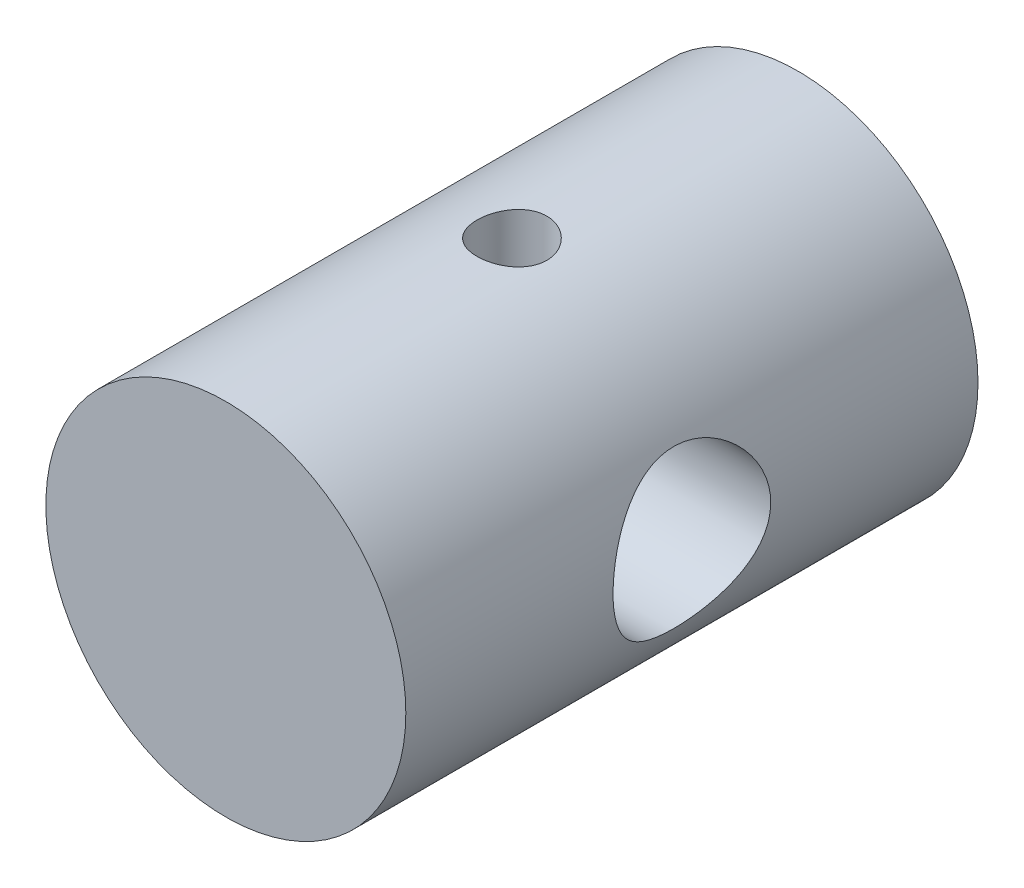
ISO-10303-21;
HEADER;
FILE_DESCRIPTION(('STEP AP214'),'2;1');
FILE_NAME('part.step','',(''),(''),'','','');
FILE_SCHEMA(('AUTOMOTIVE_DESIGN { 1 0 10303 214 1 1 1 1 }'));
ENDSEC;
DATA;
#1=APPLICATION_CONTEXT('core data for automotive mechanical design processes');
#2=APPLICATION_PROTOCOL_DEFINITION('international standard','automotive_design',2000,#1);
#3=PRODUCT_CONTEXT('',#1,'mechanical');
#4=PRODUCT('Part','Part','',(#3));
#5=PRODUCT_RELATED_PRODUCT_CATEGORY('part','',(#4));
#6=PRODUCT_DEFINITION_FORMATION('','',#4);
#7=PRODUCT_DEFINITION_CONTEXT('part definition',#1,'design');
#8=PRODUCT_DEFINITION('design','',#6,#7);
#9=PRODUCT_DEFINITION_SHAPE('','',#8);
#10=(LENGTH_UNIT() NAMED_UNIT(*) SI_UNIT(.MILLI.,.METRE.));
#11=(NAMED_UNIT(*) PLANE_ANGLE_UNIT() SI_UNIT($,.RADIAN.));
#12=(NAMED_UNIT(*) SI_UNIT($,.STERADIAN.) SOLID_ANGLE_UNIT());
#13=UNCERTAINTY_MEASURE_WITH_UNIT(LENGTH_MEASURE(1.E-05),#10,'distance_accuracy_value','');
#14=(GEOMETRIC_REPRESENTATION_CONTEXT(3) GLOBAL_UNCERTAINTY_ASSIGNED_CONTEXT((#13)) GLOBAL_UNIT_ASSIGNED_CONTEXT((#10,
#11,#12)) REPRESENTATION_CONTEXT('',''));
#15=CARTESIAN_POINT('',(0.,0.,0.));
#16=DIRECTION('',(0.,0.,1.));
#17=DIRECTION('',(1.,0.,0.));
#18=AXIS2_PLACEMENT_3D('',#15,#16,#17);
#19=CARTESIAN_POINT('',(0.,0.,25.4));
#20=DIRECTION('',(0.,0.,-1.));
#21=DIRECTION('',(-1.,0.,0.));
#22=AXIS2_PLACEMENT_3D('',#19,#20,#21);
#23=CYLINDRICAL_SURFACE('',#22,7.99);
#24=CARTESIAN_POINT('',(0.,-7.99,14.25));
#25=CARTESIAN_POINT('',(0.0861978751298495,-7.98999842231098,14.2499967674018));
#26=CARTESIAN_POINT('',(0.172437191972722,-7.98859075930084,14.2427853096281));
#27=CARTESIAN_POINT('',(0.342481834557587,-7.98311104184808,14.2141508054915));
#28=CARTESIAN_POINT('',(0.426285109089739,-7.97903680629046,14.1927161250874));
#29=CARTESIAN_POINT('',(0.588974198315108,-7.96867928535314,14.1363193045079));
#30=CARTESIAN_POINT('',(0.667864512920315,-7.9623980575206,14.1013697610034));
#31=CARTESIAN_POINT('',(0.818655284205226,-7.9483108799168,14.0189719257152));
#32=CARTESIAN_POINT('',(0.890556229375864,-7.94050503681667,13.9715245082759));
#33=CARTESIAN_POINT('',(1.02625240760753,-7.92411741098245,13.8648345792747));
#34=CARTESIAN_POINT('',(1.08994543199363,-7.91552776882728,13.8054632652412));
#35=CARTESIAN_POINT('',(1.20653313679711,-7.89859839067425,13.6768878538532));
#36=CARTESIAN_POINT('',(1.25942700747572,-7.89025867345615,13.6076830198241));
#37=CARTESIAN_POINT('',(1.35334514291691,-7.87469682894811,13.460676118599));
#38=CARTESIAN_POINT('',(1.39426448283677,-7.86748482458875,13.3828058520177));
#39=CARTESIAN_POINT('',(1.46240006584402,-7.85510617264537,13.2211325420263));
#40=CARTESIAN_POINT('',(1.48961757823757,-7.84993933561119,13.1373300489848));
#41=CARTESIAN_POINT('',(1.52924693388355,-7.8423153468224,12.9672678781094));
#42=CARTESIAN_POINT('',(1.54183758101501,-7.83982549930373,12.8810513619589));
#43=CARTESIAN_POINT('',(1.55241099834209,-7.83773890828445,12.7076964312001));
#44=CARTESIAN_POINT('',(1.55039517220651,-7.83814188678585,12.6205581059804));
#45=CARTESIAN_POINT('',(1.53195763558272,-7.84176567979317,12.4491350151866));
#46=CARTESIAN_POINT('',(1.51574008927123,-7.84494655741215,12.3648273210157));
#47=CARTESIAN_POINT('',(1.46968137404701,-7.85370493560441,12.2001525076992));
#48=CARTESIAN_POINT('',(1.43983958940467,-7.85928254449414,12.1197855668325));
#49=CARTESIAN_POINT('',(1.36718225054554,-7.8722472080614,11.9646808166584));
#50=CARTESIAN_POINT('',(1.32428503440038,-7.87964559432129,11.8899822474469));
#51=CARTESIAN_POINT('',(1.22679221117265,-7.89541082046154,11.7487668086265));
#52=CARTESIAN_POINT('',(1.17219533621401,-7.90377776525805,11.6822508269842));
#53=CARTESIAN_POINT('',(1.0517561459926,-7.9207108696417,11.5581098806869));
#54=CARTESIAN_POINT('',(0.985739393878354,-7.92927800643286,11.5006541509022));
#55=CARTESIAN_POINT('',(0.844916058245292,-7.94551649988089,11.3976063311598));
#56=CARTESIAN_POINT('',(0.770109374423323,-7.95318784631378,11.3520143766003));
#57=CARTESIAN_POINT('',(0.61364727179666,-7.96678757875038,11.2739601087841));
#58=CARTESIAN_POINT('',(0.531982399977755,-7.97271350654225,11.2415162891621));
#59=CARTESIAN_POINT('',(0.364221022567462,-7.98213589507914,11.1908551245955));
#60=CARTESIAN_POINT('',(0.278125022680507,-7.98563263239915,11.1726361600537));
#61=CARTESIAN_POINT('',(0.105400460069949,-7.98976439233566,11.1511794990004));
#62=CARTESIAN_POINT('',(0.0188017098618922,-7.99044367672728,11.1477100675722));
#63=CARTESIAN_POINT('',(-0.15373828419959,-7.98898660476214,11.1552280794807));
#64=CARTESIAN_POINT('',(-0.239679562492628,-7.98685039691604,11.1662147602912));
#65=CARTESIAN_POINT('',(-0.407723594516296,-7.98002999851957,11.2021405284203));
#66=CARTESIAN_POINT('',(-0.489852548994056,-7.9753673845908,11.2269615153625));
#67=CARTESIAN_POINT('',(-0.64878308274747,-7.96401494033863,11.2897228761182));
#68=CARTESIAN_POINT('',(-0.725584280356087,-7.95732496496411,11.3276641886758));
#69=CARTESIAN_POINT('',(-0.872662216920443,-7.94254953182289,11.416096153705));
#70=CARTESIAN_POINT('',(-0.942852890084782,-7.93444877954137,11.4667273401462));
#71=CARTESIAN_POINT('',(-1.07382484178543,-7.91778800047293,11.5789126775947));
#72=CARTESIAN_POINT('',(-1.13460517415467,-7.90922792761978,11.6404679256333));
#73=CARTESIAN_POINT('',(-1.24591875917,-7.89246523051891,11.7738061909469));
#74=CARTESIAN_POINT('',(-1.2962933776322,-7.88426945175633,11.8457226460713));
#75=CARTESIAN_POINT('',(-1.3842477449932,-7.86930472352804,11.997132758846));
#76=CARTESIAN_POINT('',(-1.42182798899722,-7.86253571885416,12.0766261231393));
#77=CARTESIAN_POINT('',(-1.48290618198976,-7.85124547324545,12.240544433606));
#78=CARTESIAN_POINT('',(-1.50647475244843,-7.84671297988975,12.3249422536092));
#79=CARTESIAN_POINT('',(-1.53907658113647,-7.84038417338833,12.4965967926561));
#80=CARTESIAN_POINT('',(-1.54811160910461,-7.83858752710195,12.5838531622957));
#81=CARTESIAN_POINT('',(-1.55132743435128,-7.83795155711542,12.7571570468987));
#82=CARTESIAN_POINT('',(-1.54575867983169,-7.83906237116802,12.8431998302404));
#83=CARTESIAN_POINT('',(-1.52047560033483,-7.84400516541365,13.0130975937471));
#84=CARTESIAN_POINT('',(-1.50076137439544,-7.84783712655489,13.0969525892254));
#85=CARTESIAN_POINT('',(-1.44785575987647,-7.85776878425971,13.2599471045278));
#86=CARTESIAN_POINT('',(-1.41469333272468,-7.86386360526504,13.3390963410897));
#87=CARTESIAN_POINT('',(-1.33586074287948,-7.87763734874023,13.4907471039831));
#88=CARTESIAN_POINT('',(-1.29018961132125,-7.88531639390518,13.5632481147939));
#89=CARTESIAN_POINT('',(-1.18677317118979,-7.90154700012123,13.7007951351408));
#90=CARTESIAN_POINT('',(-1.12884630514387,-7.91011055927908,13.7657032468729));
#91=CARTESIAN_POINT('',(-1.00293943400774,-7.92705741856957,13.8849610023149));
#92=CARTESIAN_POINT('',(-0.934957122842554,-7.93544067684626,13.9393082173989));
#93=CARTESIAN_POINT('',(-0.790074313987382,-7.95117843922266,14.036398924293));
#94=CARTESIAN_POINT('',(-0.713093383365353,-7.95852212495652,14.0790242081759));
#95=CARTESIAN_POINT('',(-0.552942586581527,-7.97124726985033,14.1506671077489));
#96=CARTESIAN_POINT('',(-0.469778495856717,-7.9766305331095,14.1796972415906));
#97=CARTESIAN_POINT('',(-0.321999134602491,-7.98375715202776,14.2175702451031));
#98=CARTESIAN_POINT('',(-0.258236462211612,-7.98608475478528,14.2297101626809));
#99=CARTESIAN_POINT('',(-0.129656989572553,-7.98920675022882,14.2459261406032));
#100=CARTESIAN_POINT('',(-0.0648402195347914,-7.99000118677754,14.2500024316421));
#101=CARTESIAN_POINT('',(0.,-7.99,14.25));
#102=B_SPLINE_CURVE_WITH_KNOTS('',3,(#24,#25,#26,#27,#28,#29,#30,#31,#32,#33,#34,#35,#36,#37,
#38,#39,#40,#41,#42,#43,#44,#45,#46,#47,#48,#49,#50,#51,#52,#53,#54,#55,#56,#57,#58,#59,#60,#61,
#62,#63,#64,#65,#66,#67,#68,#69,#70,#71,#72,#73,#74,#75,#76,#77,#78,#79,#80,#81,#82,#83,#84,#85,
#86,#87,#88,#89,#90,#91,#92,#93,#94,#95,#96,#97,#98,#99,#100,#101),.UNSPECIFIED.,.T.,.F.,(4,2,2,
2,2,2,2,2,2,2,2,2,2,2,2,2,2,2,2,2,2,2,2,2,2,2,2,2,2,2,2,2,2,2,2,2,2,2,4),(0.,0.258356459834737,
0.516924506101675,0.775252129928376,1.03356168609266,1.29482814177584,1.55611418046989,
1.81962548034444,2.08311236463688,2.3433432256181,2.60354907898222,2.86007450740786,
3.116611530312,3.37478737748871,3.63299121699184,3.89555821585245,4.15812821119313,
4.42106625563359,4.68397435840918,4.9427361951571,5.2014843833682,5.4580568000188,
5.71464757792855,5.9742162823569,6.23381106831601,6.49711095392199,6.76040064942693,
7.02235181046594,7.28427107148926,7.54172802891493,7.7991831838033,8.05608681482289,
8.31301035000702,8.57404617365163,8.83514195528014,9.09878146702062,9.36217774496427,
9.55652556186892,9.75086781855078),.UNSPECIFIED.);
#103=CARTESIAN_POINT('',(0.,-7.99,14.25));
#104=VERTEX_POINT('',#103);
#105=EDGE_CURVE('E80',#104,#104,#102,.T.);
#106=ORIENTED_EDGE('',*,*,#105,.T.);
#107=EDGE_LOOP('',(#106));
#108=FACE_BOUND('',#107,.T.);
#109=CARTESIAN_POINT('',(0.,7.99,14.2499999999997));
#110=CARTESIAN_POINT('',(-0.086197875129885,7.98999842231097,14.2499967674014));
#111=CARTESIAN_POINT('',(-0.172437191972796,7.98859075930092,14.242785309628));
#112=CARTESIAN_POINT('',(-0.342481834557628,7.98311104184817,14.2141508054915));
#113=CARTESIAN_POINT('',(-0.426285109089711,7.97903680629046,14.1927161250871));
#114=CARTESIAN_POINT('',(-0.588974198315136,7.96867928535314,14.1363193045075));
#115=CARTESIAN_POINT('',(-0.667864512920468,7.96239805752067,14.1013697610033));
#116=CARTESIAN_POINT('',(-0.818655284205362,7.94831087991688,14.0189719257152));
#117=CARTESIAN_POINT('',(-0.890556229375856,7.94050503681668,13.9715245082756));
#118=CARTESIAN_POINT('',(-1.02625240760754,7.92411741098244,13.8648345792743));
#119=CARTESIAN_POINT('',(-1.0899454319938,7.91552776882734,13.805463265241));
#120=CARTESIAN_POINT('',(-1.20653313679728,7.89859839067431,13.676887853853));
#121=CARTESIAN_POINT('',(-1.25942700747573,7.89025867345615,13.6076830198238));
#122=CARTESIAN_POINT('',(-1.35334514291689,7.87469682894811,13.4606761185986));
#123=CARTESIAN_POINT('',(-1.39426448283688,7.86748482458881,13.3828058520174));
#124=CARTESIAN_POINT('',(-1.46240006584415,7.85510617264543,13.221132542026));
#125=CARTESIAN_POINT('',(-1.48961757823761,7.84993933561118,13.1373300489845));
#126=CARTESIAN_POINT('',(-1.52924693388352,7.8423153468224,12.9672678781091));
#127=CARTESIAN_POINT('',(-1.54183758101501,7.83982549930382,12.8810513619586));
#128=CARTESIAN_POINT('',(-1.55241099834213,7.83773890828453,12.7076964311998));
#129=CARTESIAN_POINT('',(-1.55039517220655,7.83814188678585,12.62055810598));
#130=CARTESIAN_POINT('',(-1.53195763558269,7.84176567979317,12.4491350151863));
#131=CARTESIAN_POINT('',(-1.51574008927113,7.84494655741226,12.3648273210154));
#132=CARTESIAN_POINT('',(-1.46968137404694,7.85370493560451,12.2001525076988));
#133=CARTESIAN_POINT('',(-1.43983958940469,7.85928254449415,12.1197855668321));
#134=CARTESIAN_POINT('',(-1.36718225054552,7.87224720806139,11.9646808166581));
#135=CARTESIAN_POINT('',(-1.32428503440022,7.87964559432139,11.8899822474467));
#136=CARTESIAN_POINT('',(-1.22679221117251,7.89541082046167,11.7487668086263));
#137=CARTESIAN_POINT('',(-1.17219533621401,7.9037777652581,11.6822508269838));
#138=CARTESIAN_POINT('',(-1.0517561459926,7.92071086964174,11.5581098806866));
#139=CARTESIAN_POINT('',(-0.985739393878205,7.92927800643296,11.5006541509021));
#140=CARTESIAN_POINT('',(-0.844916058245133,7.94551649988099,11.3976063311597));
#141=CARTESIAN_POINT('',(-0.770109374423304,7.95318784631382,11.3520143766));
#142=CARTESIAN_POINT('',(-0.613647271796682,7.96678757875041,11.2739601087838));
#143=CARTESIAN_POINT('',(-0.531982399977679,7.97271350654233,11.2415162891621));
#144=CARTESIAN_POINT('',(-0.364221022567359,7.98213589507923,11.1908551245955));
#145=CARTESIAN_POINT('',(-0.278125022680474,7.9856326323992,11.1726361600534));
#146=CARTESIAN_POINT('',(-0.105400460069982,7.9897643923357,11.1511794990001));
#147=CARTESIAN_POINT('',(-0.0188017098619216,7.99044367672736,11.1477100675722));
#148=CARTESIAN_POINT('',(0.153738284199593,7.98898660476223,11.1552280794807));
#149=CARTESIAN_POINT('',(0.239679562492659,7.98685039691608,11.1662147602909));
#150=CARTESIAN_POINT('',(0.407723594516267,7.98002999851962,11.2021405284199));
#151=CARTESIAN_POINT('',(0.48985254899394,7.97536738459089,11.2269615153624));
#152=CARTESIAN_POINT('',(0.648783082747375,7.96401494033872,11.2897228761181));
#153=CARTESIAN_POINT('',(0.725584280356101,7.95732496496415,11.3276641886755));
#154=CARTESIAN_POINT('',(0.872662216920427,7.94254953182294,11.4160961537047));
#155=CARTESIAN_POINT('',(0.942852890084626,7.93444877954147,11.466727340146));
#156=CARTESIAN_POINT('',(1.07382484178528,7.91778800047303,11.5789126775946));
#157=CARTESIAN_POINT('',(1.13460517415466,7.90922792761982,11.640467925633));
#158=CARTESIAN_POINT('',(1.24591875917,7.89246523051896,11.7738061909465));
#159=CARTESIAN_POINT('',(1.29629337763207,7.88426945175645,11.8457226460711));
#160=CARTESIAN_POINT('',(1.38424774499306,7.86930472352813,11.9971327588457));
#161=CARTESIAN_POINT('',(1.42182798899719,7.86253571885416,12.076626123139));
#162=CARTESIAN_POINT('',(1.48290618198979,7.85124547324545,12.2405444336057));
#163=CARTESIAN_POINT('',(1.50647475244839,7.84671297988984,12.3249422536089));
#164=CARTESIAN_POINT('',(1.53907658113639,7.84038417338842,12.4965967926558));
#165=CARTESIAN_POINT('',(1.54811160910458,7.83858752710195,12.5838531622954));
#166=CARTESIAN_POINT('',(1.55132743435132,7.83795155711541,12.7571570468984));
#167=CARTESIAN_POINT('',(1.54575867983175,7.83906237116808,12.8431998302401));
#168=CARTESIAN_POINT('',(1.52047560033486,7.84400516541372,13.0130975937468));
#169=CARTESIAN_POINT('',(1.50076137439541,7.84783712655489,13.0969525892251));
#170=CARTESIAN_POINT('',(1.4478557598765,7.85776878425971,13.2599471045275));
#171=CARTESIAN_POINT('',(1.41469333272483,7.8638636052651,13.3390963410894));
#172=CARTESIAN_POINT('',(1.3358607428796,7.87763734874029,13.4907471039829));
#173=CARTESIAN_POINT('',(1.29018961132124,7.88531639390519,13.5632481147935));
#174=CARTESIAN_POINT('',(1.1867731711898,7.90154700012124,13.7007951351405));
#175=CARTESIAN_POINT('',(1.12884630514403,7.91011055927914,13.7657032468728));
#176=CARTESIAN_POINT('',(1.00293943400791,7.92705741856963,13.8849610023148));
#177=CARTESIAN_POINT('',(0.934957122842568,7.93544067684626,13.9393082173985));
#178=CARTESIAN_POINT('',(0.790074313987368,7.95117843922266,14.0363989242927));
#179=CARTESIAN_POINT('',(0.713093383365464,7.9585221249566,14.0790242081759));
#180=CARTESIAN_POINT('',(0.552942586581653,7.9712472698504,14.1506671077489));
#181=CARTESIAN_POINT('',(0.469778495856731,7.97663053310949,14.1796972415902));
#182=CARTESIAN_POINT('',(0.32199913460248,7.98375715202778,14.2175702451029));
#183=CARTESIAN_POINT('',(0.258236462211644,7.98608475478537,14.2297101626809));
#184=CARTESIAN_POINT('',(0.129656989572603,7.98920675022891,14.2459261406032));
#185=CARTESIAN_POINT('',(0.0648402195348172,7.99000118677755,14.2500024316418));
#186=CARTESIAN_POINT('',(0.,7.99,14.2499999999997));
#187=B_SPLINE_CURVE_WITH_KNOTS('',3,(#109,#110,#111,#112,#113,#114,#115,#116,#117,#118,#119,
#120,#121,#122,#123,#124,#125,#126,#127,#128,#129,#130,#131,#132,#133,#134,#135,#136,#137,#138,
#139,#140,#141,#142,#143,#144,#145,#146,#147,#148,#149,#150,#151,#152,#153,#154,#155,#156,#157,
#158,#159,#160,#161,#162,#163,#164,#165,#166,#167,#168,#169,#170,#171,#172,#173,#174,#175,#176,
#177,#178,#179,#180,#181,#182,#183,#184,#185,#186),.UNSPECIFIED.,.T.,.F.,(4,2,2,2,2,2,2,2,2,2,2,
2,2,2,2,2,2,2,2,2,2,2,2,2,2,2,2,2,2,2,2,2,2,2,2,2,2,2,4),(0.,0.258356459834767,
0.516924506101733,0.775252129928456,1.03356168609277,1.29482814177597,1.55611418047003,
1.8196254803446,2.08311236463704,2.34334322561826,2.60354907898238,2.86007450740801,
3.11661153031214,3.37478737748885,3.63299121699196,3.89555821585254,4.15812821119321,
4.42106625563364,4.68397435840921,4.94273619515709,5.20148438336817,5.45805680001875,
5.71464757792848,5.9742162823568,6.23381106831588,6.49711095392185,6.76040064942678,
7.02235181046578,7.2842710714891,7.54172802891476,7.79918318380314,8.05608681482274,
8.31301035000688,8.57404617365153,8.83514195528007,9.09878146702057,9.36217774496425,
9.55652556186892,9.75086781855079),.UNSPECIFIED.);
#188=CARTESIAN_POINT('',(0.,7.99,14.2499999999997));
#189=VERTEX_POINT('',#188);
#190=EDGE_CURVE('E87',#189,#189,#187,.T.);
#191=ORIENTED_EDGE('',*,*,#190,.T.);
#192=EDGE_LOOP('',(#191));
#193=FACE_BOUND('',#192,.T.);
#194=CARTESIAN_POINT('',(-7.99,0.,16.2));
#195=CARTESIAN_POINT('',(-7.98999940645756,-0.0933555632040283,16.1999992715551));
#196=CARTESIAN_POINT('',(-7.98835937207083,-0.186736990343479,16.1962597470269));
#197=CARTESIAN_POINT('',(-7.98184059760594,-0.372827965267293,16.1813392002767));
#198=CARTESIAN_POINT('',(-7.9769599604369,-0.465537087318454,16.1701538191438));
#199=CARTESIAN_POINT('',(-7.96407385217844,-0.649739115397789,16.1404292969723));
#200=CARTESIAN_POINT('',(-7.95606240087184,-0.741229345273337,16.121876081413));
#201=CARTESIAN_POINT('',(-7.93712834599139,-0.922167150598465,16.0776174372529));
#202=CARTESIAN_POINT('',(-7.92620455246537,-1.01161387483776,16.05190908495));
#203=CARTESIAN_POINT('',(-7.88955480015671,-1.2752646728038,15.9646295237854));
#204=CARTESIAN_POINT('',(-7.85988633503715,-1.44564111414516,15.8927623595147));
#205=CARTESIAN_POINT('',(-7.79289132316899,-1.77164835601812,15.7240735259388));
#206=CARTESIAN_POINT('',(-7.75556665535945,-1.92728276077864,15.6272579778242));
#207=CARTESIAN_POINT('',(-7.67467046191351,-2.22822415839992,15.405844283514));
#208=CARTESIAN_POINT('',(-7.63088076105272,-2.37263444695928,15.2801051888681));
#209=CARTESIAN_POINT('',(-7.54288073530597,-2.63908802190461,15.0068814052114));
#210=CARTESIAN_POINT('',(-7.49867018226356,-2.76111835230601,14.8593842087978));
#211=CARTESIAN_POINT('',(-7.412040863024,-2.98615423470738,14.5367339889714));
#212=CARTESIAN_POINT('',(-7.36985901351598,-3.08772174487033,14.3604982258613));
#213=CARTESIAN_POINT('',(-7.31416276552725,-3.2164116179919,14.0838660292637));
#214=CARTESIAN_POINT('',(-7.29685503607835,-3.25537484537807,13.9895712042559));
#215=CARTESIAN_POINT('',(-7.2653723342682,-3.32504565901619,13.7974910081588));
#216=CARTESIAN_POINT('',(-7.25119569846477,-3.35575763076219,13.6997075227039));
#217=CARTESIAN_POINT('',(-7.22715498222366,-3.40721240413967,13.5064661597537));
#218=CARTESIAN_POINT('',(-7.21710740001487,-3.4283847888399,13.4111451745344));
#219=CARTESIAN_POINT('',(-7.20069971258177,-3.4627136771602,13.2187987003171));
#220=CARTESIAN_POINT('',(-7.19433784860628,-3.47587400412702,13.1217740470862));
#221=CARTESIAN_POINT('',(-7.18554605304706,-3.49401401305617,12.9268098198105));
#222=CARTESIAN_POINT('',(-7.18311483776571,-3.49899636584433,12.8288705549798));
#223=CARTESIAN_POINT('',(-7.18226784353274,-3.50073080205259,12.6329321396467));
#224=CARTESIAN_POINT('',(-7.18385181811993,-3.49748339063374,12.5349329931892));
#225=CARTESIAN_POINT('',(-7.19395646519866,-3.47669447839069,12.2590133588347));
#226=CARTESIAN_POINT('',(-7.2071227618517,-3.44956867797695,12.081876241264));
#227=CARTESIAN_POINT('',(-7.24508776994002,-3.36908300087457,11.7350920733107));
#228=CARTESIAN_POINT('',(-7.26988899921975,-3.31571744568104,11.5654466528588));
#229=CARTESIAN_POINT('',(-7.32888438325789,-3.18322225141475,11.233823092722));
#230=CARTESIAN_POINT('',(-7.36327495146892,-3.10354662999734,11.0720989828975));
#231=CARTESIAN_POINT('',(-7.43754473119499,-2.92108088589546,10.7636530843082));
#232=CARTESIAN_POINT('',(-7.47742622048713,-2.81828115945464,10.6169375657522));
#233=CARTESIAN_POINT('',(-7.56275323063334,-2.58111932538558,10.3280927082573));
#234=CARTESIAN_POINT('',(-7.60836871022337,-2.44469451089092,10.1877018905046));
#235=CARTESIAN_POINT('',(-7.69688124503859,-2.14983743525209,9.93117358901635));
#236=CARTESIAN_POINT('',(-7.73977752161396,-1.99139891151848,9.81504303060228));
#237=CARTESIAN_POINT('',(-7.81951270873595,-1.65125233500675,9.60740559873549));
#238=CARTESIAN_POINT('',(-7.85614884760368,-1.46901774370946,9.5166775228002));
#239=CARTESIAN_POINT('',(-7.91764488274121,-1.08985534423412,9.36778960599213));
#240=CARTESIAN_POINT('',(-7.94251198686177,-0.892936615011946,9.30960982719052));
#241=CARTESIAN_POINT('',(-7.97627758898768,-0.50446323070999,9.23127440183259));
#242=CARTESIAN_POINT('',(-7.98615212177529,-0.313463182575408,9.20878980468777));
#243=CARTESIAN_POINT('',(-7.99199044516102,0.0698238195404293,9.19545148874569));
#244=CARTESIAN_POINT('',(-7.98795878213152,0.262110332420599,9.20458743220346));
#245=CARTESIAN_POINT('',(-7.96706012250989,0.631129944462346,9.25262976986222));
#246=CARTESIAN_POINT('',(-7.95092557162223,0.808130562202917,9.28983799590785));
#247=CARTESIAN_POINT('',(-7.90826102907679,1.15314462806709,9.39053406561438));
#248=CARTESIAN_POINT('',(-7.88172976147415,1.32115697022038,9.45402513491086));
#249=CARTESIAN_POINT('',(-7.81974616715114,1.64937857234419,9.607524705566));
#250=CARTESIAN_POINT('',(-7.78404100380944,1.8091800047734,9.69829975869556));
#251=CARTESIAN_POINT('',(-7.70743578363308,2.11185901295927,9.90295442446756));
#252=CARTESIAN_POINT('',(-7.66653348242443,2.25472922517593,10.0168440318535));
#253=CARTESIAN_POINT('',(-7.57992148385186,2.531305803477,10.274920285361));
#254=CARTESIAN_POINT('',(-7.534086449703,2.66341253079708,10.4207833836155));
#255=CARTESIAN_POINT('',(-7.44553056669965,2.9017895410352,10.7332154498182));
#256=CARTESIAN_POINT('',(-7.40281072540649,3.00805149058008,10.8997910702038));
#257=CARTESIAN_POINT('',(-7.32471112589163,3.19360202154486,11.2537477808718));
#258=CARTESIAN_POINT('',(-7.28950590164075,3.27227195790534,11.4414946669971));
#259=CARTESIAN_POINT('',(-7.23263508307893,3.39614772411549,11.8296138130106));
#260=CARTESIAN_POINT('',(-7.21095673216798,3.44138509020219,12.0299739809162));
#261=CARTESIAN_POINT('',(-7.18568241098851,3.49382858695149,12.4197110229249));
#262=CARTESIAN_POINT('',(-7.1807341822558,3.50388127788352,12.608618055004));
#263=CARTESIAN_POINT('',(-7.18582513778219,3.49343058463278,12.9853579920426));
#264=CARTESIAN_POINT('',(-7.19586136359001,3.47293323209006,13.1731911016823));
#265=CARTESIAN_POINT('',(-7.22850085319678,3.40443447066335,13.5313861791334));
#266=CARTESIAN_POINT('',(-7.25035786566767,3.35806156149568,13.7021344949671));
#267=CARTESIAN_POINT('',(-7.30351520470532,3.2408155130438,14.033421405943));
#268=CARTESIAN_POINT('',(-7.33481824201789,3.16993534000565,14.1939570543007));
#269=CARTESIAN_POINT('',(-7.40579054103911,3.00054933810098,14.5113783016472));
#270=CARTESIAN_POINT('',(-7.44586386518533,2.90057920285926,14.6673901031656));
#271=CARTESIAN_POINT('',(-7.52885894902648,2.67777867578567,14.9613122263572));
#272=CARTESIAN_POINT('',(-7.57178184954843,2.55493909223222,15.0992152315776));
#273=CARTESIAN_POINT('',(-7.65996061926113,2.2777162294809,15.3649414767467));
#274=CARTESIAN_POINT('',(-7.70510979419167,2.1215504842893,15.4909463386446));
#275=CARTESIAN_POINT('',(-7.78912632025058,1.78857063261291,15.7151670583796));
#276=CARTESIAN_POINT('',(-7.82799081286411,1.6117471928441,15.8133702861254));
#277=CARTESIAN_POINT('',(-7.8780807489238,1.3358931845712,15.9365742652532));
#278=CARTESIAN_POINT('',(-7.89334391778952,1.24274596815932,15.9734787942524));
#279=CARTESIAN_POINT('',(-7.92085306787174,1.05324482550984,16.0392684633928));
#280=CARTESIAN_POINT('',(-7.93310049654032,0.956892462938647,16.068157451567));
#281=CARTESIAN_POINT('',(-7.95418908830952,0.76195298208879,16.1175311917384));
#282=CARTESIAN_POINT('',(-7.96303845501786,0.663371862169421,16.1380361922385));
#283=CARTESIAN_POINT('',(-7.97710187568604,0.464602541999617,16.1704856293238));
#284=CARTESIAN_POINT('',(-7.98231848846688,0.364415523894189,16.1824360916777));
#285=CARTESIAN_POINT('',(-7.98709199890144,0.219988432385882,16.1933572565911));
#286=CARTESIAN_POINT('',(-7.98818169432058,0.176037177429541,16.1958473767491));
#287=CARTESIAN_POINT('',(-7.98963583822739,0.0880592000737542,16.1991689279772));
#288=CARTESIAN_POINT('',(-7.99000027995272,0.0440324769744666,16.2000003435814));
#289=CARTESIAN_POINT('',(-7.99,0.,16.2));
#290=B_SPLINE_CURVE_WITH_KNOTS('',3,(#194,#195,#196,#197,#198,#199,#200,#201,#202,#203,#204,
#205,#206,#207,#208,#209,#210,#211,#212,#213,#214,#215,#216,#217,#218,#219,#220,#221,#222,#223,
#224,#225,#226,#227,#228,#229,#230,#231,#232,#233,#234,#235,#236,#237,#238,#239,#240,#241,#242,
#243,#244,#245,#246,#247,#248,#249,#250,#251,#252,#253,#254,#255,#256,#257,#258,#259,#260,#261,
#262,#263,#264,#265,#266,#267,#268,#269,#270,#271,#272,#273,#274,#275,#276,#277,#278,#279,#280,
#281,#282,#283,#284,#285,#286,#287,#288,#289),.UNSPECIFIED.,.T.,.F.,(4,2,2,2,2,2,2,2,2,2,2,2,2,
2,2,2,2,2,2,2,2,2,2,2,2,2,2,2,2,2,2,2,2,2,2,2,2,2,2,2,2,2,2,2,2,2,2,4),(0.,0.280022125067571,
0.560208323421317,0.840932346496955,1.12177124668699,1.68085542701686,2.23980256408668,
2.82650772250282,3.4135514656693,4.03328929432629,4.3433908798779,4.6533273207276,
4.94740994788792,5.24135212885805,5.53519829281103,5.82902642027653,6.36532672073635,
6.9017431322319,7.45007533389529,7.99863568724662,8.59894871457275,9.19943287349466,
9.81669755479172,10.4335837065237,11.0082687405681,11.5827659098269,12.1250469746889,
12.6673946122543,13.2266878479801,13.7862234395715,14.3896803591573,14.9933315998025,
15.6097620519592,16.2256102935413,16.7903106845625,17.354899598874,17.8874172145081,
18.4200877934164,18.9864653237119,19.553070986654,20.1672482446307,20.7817040730125,
21.0854070390066,21.388963952588,21.6917833405795,21.9943892138314,22.1264643937779,
22.2585408052009),.UNSPECIFIED.);
#291=CARTESIAN_POINT('',(-7.99,0.,16.2));
#292=VERTEX_POINT('',#291);
#293=EDGE_CURVE('E10',#292,#292,#290,.T.);
#294=ORIENTED_EDGE('',*,*,#293,.T.);
#295=EDGE_LOOP('',(#294));
#296=FACE_BOUND('',#295,.T.);
#297=CARTESIAN_POINT('',(7.99,0.,9.20000000000001));
#298=CARTESIAN_POINT('',(7.98999940645756,-0.0933555632040676,9.20000072844492));
#299=CARTESIAN_POINT('',(7.98835937207083,-0.186736990343517,9.20374025297313));
#300=CARTESIAN_POINT('',(7.98184059760594,-0.372827965267329,9.21866079972335));
#301=CARTESIAN_POINT('',(7.97695996043689,-0.465537087318491,9.2298461808562));
#302=CARTESIAN_POINT('',(7.96407385217843,-0.649739115397826,9.25957070302772));
#303=CARTESIAN_POINT('',(7.95606240087184,-0.741229345273374,9.27812391858704));
#304=CARTESIAN_POINT('',(7.93712834599138,-0.922167150598504,9.32238256274718));
#305=CARTESIAN_POINT('',(7.92620455246537,-1.01161387483781,9.34809091505008));
#306=CARTESIAN_POINT('',(7.88955480015671,-1.27526467280384,9.43537047621459));
#307=CARTESIAN_POINT('',(7.85988633503714,-1.44564111414519,9.50723764048531));
#308=CARTESIAN_POINT('',(7.79289132316898,-1.77164835601815,9.67592647406128));
#309=CARTESIAN_POINT('',(7.75556665535945,-1.92728276077869,9.77274202217583));
#310=CARTESIAN_POINT('',(7.67467046191351,-2.22822415839996,9.994155716486));
#311=CARTESIAN_POINT('',(7.63088076105272,-2.37263444695928,10.1198948111319));
#312=CARTESIAN_POINT('',(7.54288073530597,-2.63908802190458,10.3931185947886));
#313=CARTESIAN_POINT('',(7.49867018226356,-2.76111835230597,10.5406157912023));
#314=CARTESIAN_POINT('',(7.412040863024,-2.98615423470734,10.8632660110286));
#315=CARTESIAN_POINT('',(7.36985901351598,-3.08772174487031,11.0395017741387));
#316=CARTESIAN_POINT('',(7.31416276552726,-3.21641161799189,11.3161339707363));
#317=CARTESIAN_POINT('',(7.29685503607835,-3.25537484537806,11.4104287957441));
#318=CARTESIAN_POINT('',(7.2653723342682,-3.32504565901619,11.6025089918412));
#319=CARTESIAN_POINT('',(7.25119569846478,-3.35575763076219,11.7002924772962));
#320=CARTESIAN_POINT('',(7.22715498222366,-3.40721240413967,11.8935338402463));
#321=CARTESIAN_POINT('',(7.21710740001488,-3.4283847888399,11.9888548254656));
#322=CARTESIAN_POINT('',(7.20069971258177,-3.4627136771602,12.1812012996829));
#323=CARTESIAN_POINT('',(7.19433784860628,-3.47587400412702,12.2782259529138));
#324=CARTESIAN_POINT('',(7.18554605304707,-3.49401401305617,12.4731901801895));
#325=CARTESIAN_POINT('',(7.18311483776571,-3.49899636584433,12.5711294450202));
#326=CARTESIAN_POINT('',(7.18226784353274,-3.50073080205259,12.7670678603533));
#327=CARTESIAN_POINT('',(7.18385181811993,-3.49748339063374,12.8650670068108));
#328=CARTESIAN_POINT('',(7.19395646519866,-3.47669447839069,13.1409866411653));
#329=CARTESIAN_POINT('',(7.2071227618517,-3.44956867797697,13.318123758736));
#330=CARTESIAN_POINT('',(7.24508776994001,-3.36908300087458,13.6649079266893));
#331=CARTESIAN_POINT('',(7.26988899921975,-3.31571744568104,13.8345533471412));
#332=CARTESIAN_POINT('',(7.32888438325789,-3.18322225141476,14.166176907278));
#333=CARTESIAN_POINT('',(7.36327495146892,-3.10354662999735,14.3279010171025));
#334=CARTESIAN_POINT('',(7.43754473119498,-2.92108088589548,14.6363469156918));
#335=CARTESIAN_POINT('',(7.47742622048713,-2.81828115945464,14.7830624342478));
#336=CARTESIAN_POINT('',(7.56275323063334,-2.58111932538558,15.0719072917427));
#337=CARTESIAN_POINT('',(7.60836871022337,-2.44469451089092,15.2122981094955));
#338=CARTESIAN_POINT('',(7.69688124503859,-2.14983743525208,15.4688264109837));
#339=CARTESIAN_POINT('',(7.73977752161396,-1.99139891151844,15.5849569693978));
#340=CARTESIAN_POINT('',(7.81951270873596,-1.6512523350067,15.7925944012645));
#341=CARTESIAN_POINT('',(7.85614884760369,-1.46901774370942,15.8833224771999));
#342=CARTESIAN_POINT('',(7.91764488274122,-1.08985534423408,16.0322103940079));
#343=CARTESIAN_POINT('',(7.94251198686178,-0.892936615011906,16.0903901728095));
#344=CARTESIAN_POINT('',(7.97627758898768,-0.504463230709945,16.1687255981674));
#345=CARTESIAN_POINT('',(7.98615212177529,-0.313463182575364,16.1912101953123));
#346=CARTESIAN_POINT('',(7.99199044516102,0.0698238195404705,16.2045485112543));
#347=CARTESIAN_POINT('',(7.98795878213153,0.262110332420638,16.1954125677965));
#348=CARTESIAN_POINT('',(7.96706012250989,0.631129944462391,16.1473702301378));
#349=CARTESIAN_POINT('',(7.95092557162223,0.808130562202968,16.1101620040922));
#350=CARTESIAN_POINT('',(7.90826102907679,1.15314462806714,16.0094659343856));
#351=CARTESIAN_POINT('',(7.88172976147416,1.32115697022042,15.9459748650891));
#352=CARTESIAN_POINT('',(7.81974616715114,1.64937857234423,15.792475294434));
#353=CARTESIAN_POINT('',(7.78404100380943,1.80918000477345,15.7017002413044));
#354=CARTESIAN_POINT('',(7.70743578363307,2.1118590129593,15.4970455755324));
#355=CARTESIAN_POINT('',(7.66653348242442,2.25472922517593,15.3831559681465));
#356=CARTESIAN_POINT('',(7.57992148385186,2.531305803477,15.125079714639));
#357=CARTESIAN_POINT('',(7.53408644970299,2.66341253079711,14.9792166163845));
#358=CARTESIAN_POINT('',(7.44553056669964,2.90178954103521,14.6667845501818));
#359=CARTESIAN_POINT('',(7.40281072540649,3.00805149058004,14.5002089297962));
#360=CARTESIAN_POINT('',(7.32471112589164,3.19360202154482,14.1462522191282));
#361=CARTESIAN_POINT('',(7.28950590164075,3.27227195790533,13.9585053330029));
#362=CARTESIAN_POINT('',(7.23263508307893,3.39614772411551,13.5703861869894));
#363=CARTESIAN_POINT('',(7.21095673216798,3.4413850902022,13.3700260190838));
#364=CARTESIAN_POINT('',(7.18568241098851,3.49382858695149,12.9802889770751));
#365=CARTESIAN_POINT('',(7.1807341822558,3.50388127788351,12.7913819449961));
#366=CARTESIAN_POINT('',(7.18582513778219,3.49343058463278,12.4146420079575));
#367=CARTESIAN_POINT('',(7.19586136359001,3.47293323209006,12.2268088983177));
#368=CARTESIAN_POINT('',(7.22850085319679,3.40443447066335,11.8686138208666));
#369=CARTESIAN_POINT('',(7.25035786566767,3.35806156149566,11.6978655050329));
#370=CARTESIAN_POINT('',(7.30351520470532,3.2408155130438,11.366578594057));
#371=CARTESIAN_POINT('',(7.33481824201789,3.16993534000569,11.2060429456993));
#372=CARTESIAN_POINT('',(7.4057905410391,3.00054933810102,10.8886216983528));
#373=CARTESIAN_POINT('',(7.44586386518534,2.90057920285926,10.7326098968344));
#374=CARTESIAN_POINT('',(7.52885894902648,2.67777867578565,10.4386877736428));
#375=CARTESIAN_POINT('',(7.57178184954843,2.55493909223222,10.3007847684224));
#376=CARTESIAN_POINT('',(7.65996061926113,2.2777162294809,10.0350585232533));
#377=CARTESIAN_POINT('',(7.70510979419168,2.12155048428928,9.90905366135541));
#378=CARTESIAN_POINT('',(7.78912632025059,1.78857063261287,9.68483294162037));
#379=CARTESIAN_POINT('',(7.82799081286411,1.61174719284407,9.58662971387455));
#380=CARTESIAN_POINT('',(7.8780807489238,1.33589318457116,9.46342573474675));
#381=CARTESIAN_POINT('',(7.89334391778953,1.24274596815927,9.42652120574762));
#382=CARTESIAN_POINT('',(7.92085306787175,1.05324482550978,9.36073153660722));
#383=CARTESIAN_POINT('',(7.93310049654032,0.956892462938596,9.33184254843304));
#384=CARTESIAN_POINT('',(7.95418908830952,0.761952982088738,9.2824688082616));
#385=CARTESIAN_POINT('',(7.96303845501787,0.663371862169368,9.26196380776149));
#386=CARTESIAN_POINT('',(7.97710187568604,0.464602541999568,9.2295143706762));
#387=CARTESIAN_POINT('',(7.98231848846688,0.364415523894146,9.21756390832227));
#388=CARTESIAN_POINT('',(7.98709199890144,0.219988432385841,9.20664274340889));
#389=CARTESIAN_POINT('',(7.98818169432058,0.176037177429499,9.20415262325088));
#390=CARTESIAN_POINT('',(7.98963583822739,0.0880592000737118,9.20083107202279));
#391=CARTESIAN_POINT('',(7.99000027995272,0.0440324769744246,9.19999965641863));
#392=CARTESIAN_POINT('',(7.99,0.,9.20000000000001));
#393=B_SPLINE_CURVE_WITH_KNOTS('',3,(#297,#298,#299,#300,#301,#302,#303,#304,#305,#306,#307,
#308,#309,#310,#311,#312,#313,#314,#315,#316,#317,#318,#319,#320,#321,#322,#323,#324,#325,#326,
#327,#328,#329,#330,#331,#332,#333,#334,#335,#336,#337,#338,#339,#340,#341,#342,#343,#344,#345,
#346,#347,#348,#349,#350,#351,#352,#353,#354,#355,#356,#357,#358,#359,#360,#361,#362,#363,#364,
#365,#366,#367,#368,#369,#370,#371,#372,#373,#374,#375,#376,#377,#378,#379,#380,#381,#382,#383,
#384,#385,#386,#387,#388,#389,#390,#391,#392),.UNSPECIFIED.,.T.,.F.,(4,2,2,2,2,2,2,2,2,2,2,2,2,
2,2,2,2,2,2,2,2,2,2,2,2,2,2,2,2,2,2,2,2,2,2,2,2,2,2,2,2,2,2,2,2,2,2,4),(0.,0.280022125067566,
0.560208323421314,0.840932346496953,1.12177124668699,1.68085542701685,2.23980256408666,
2.82650772250277,3.41355146566922,4.03328929432623,4.34339087987783,4.65332732072754,
4.94740994788786,5.24135212885798,5.53519829281095,5.82902642027644,6.36532672073627,
6.90174313223182,7.45007533389521,7.99863568724657,8.59894871457272,9.19943287349466,
9.81669755479171,10.4335837065237,11.0082687405681,11.5827659098269,12.1250469746889,
12.6673946122543,13.2266878479801,13.7862234395715,14.3896803591572,14.9933315998024,
15.6097620519592,16.2256102935412,16.7903106845624,17.354899598874,17.8874172145081,
18.4200877934163,18.9864653237118,19.553070986654,20.1672482446306,20.7817040730125,
21.0854070390066,21.388963952588,21.6917833405795,21.9943892138314,22.1264643937779,
22.2585408052009),.UNSPECIFIED.);
#394=CARTESIAN_POINT('',(7.99,0.,9.20000000000001));
#395=VERTEX_POINT('',#394);
#396=EDGE_CURVE('E39',#395,#395,#393,.T.);
#397=ORIENTED_EDGE('',*,*,#396,.T.);
#398=EDGE_LOOP('',(#397));
#399=FACE_BOUND('',#398,.T.);
#400=CARTESIAN_POINT('',(0.,0.,25.4));
#401=DIRECTION('',(0.,0.,1.));
#402=DIRECTION('',(1.,0.,0.));
#403=AXIS2_PLACEMENT_3D('',#400,#401,#402);
#404=CIRCLE('',#403,7.99);
#405=CARTESIAN_POINT('',(7.99,0.,25.4));
#406=VERTEX_POINT('',#405);
#407=EDGE_CURVE('E44',#406,#406,#404,.T.);
#408=ORIENTED_EDGE('',*,*,#407,.F.);
#409=EDGE_LOOP('',(#408));
#410=FACE_BOUND('',#409,.T.);
#411=CARTESIAN_POINT('',(0.,0.,0.));
#412=DIRECTION('',(0.,0.,1.));
#413=DIRECTION('',(1.,0.,0.));
#414=AXIS2_PLACEMENT_3D('',#411,#412,#413);
#415=CIRCLE('',#414,7.99);
#416=CARTESIAN_POINT('',(7.99,0.,0.));
#417=VERTEX_POINT('',#416);
#418=EDGE_CURVE('E78',#417,#417,#415,.T.);
#419=ORIENTED_EDGE('',*,*,#418,.T.);
#420=EDGE_LOOP('',(#419));
#421=FACE_BOUND('',#420,.T.);
#422=ADVANCED_FACE('F27',(#108,#193,#296,#399,#410,#421),#23,.T.);
#423=CARTESIAN_POINT('',(0.,0.,25.4));
#424=DIRECTION('',(0.,0.,1.));
#425=DIRECTION('',(1.,0.,0.));
#426=AXIS2_PLACEMENT_3D('',#423,#424,#425);
#427=PLANE('',#426);
#428=ORIENTED_EDGE('',*,*,#407,.T.);
#429=EDGE_LOOP('',(#428));
#430=FACE_BOUND('',#429,.T.);
#431=ADVANCED_FACE('F67',(#430),#427,.T.);
#432=CARTESIAN_POINT('',(0.,0.,0.));
#433=DIRECTION('',(0.,0.,1.));
#434=DIRECTION('',(1.,0.,0.));
#435=AXIS2_PLACEMENT_3D('',#432,#433,#434);
#436=PLANE('',#435);
#437=ORIENTED_EDGE('',*,*,#418,.F.);
#438=EDGE_LOOP('',(#437));
#439=FACE_BOUND('',#438,.T.);
#440=ADVANCED_FACE('F59',(#439),#436,.F.);
#441=CARTESIAN_POINT('',(-7.99,0.,12.7));
#442=DIRECTION('',(1.,0.,0.));
#443=DIRECTION('',(0.,0.,-1.));
#444=AXIS2_PLACEMENT_3D('',#441,#442,#443);
#445=CYLINDRICAL_SURFACE('',#444,3.5);
#446=CARTESIAN_POINT('',(0.,-3.13807265690264,14.25));
#447=CARTESIAN_POINT('',(-0.0821104668647527,-3.13807695646471,14.2499960628064));
#448=CARTESIAN_POINT('',(-0.164354760905686,-3.14134219324455,14.2434337628298));
#449=CARTESIAN_POINT('',(-0.326424098362034,-3.15396270018,14.2174707187538));
#450=CARTESIAN_POINT('',(-0.406242438994341,-3.16333347633609,14.1980372842529));
#451=CARTESIAN_POINT('',(-0.560823612512295,-3.1868804329675,14.1472612387682));
#452=CARTESIAN_POINT('',(-0.635607165092622,-3.2010352649514,14.1159714619629));
#453=CARTESIAN_POINT('',(-0.778844048412324,-3.23252302347936,14.0425295372892));
#454=CARTESIAN_POINT('',(-0.847298307239631,-3.24985548296073,14.0003789854201));
#455=CARTESIAN_POINT('',(-0.980797467129402,-3.28711001002045,13.9032367754428));
#456=CARTESIAN_POINT('',(-1.04534379777145,-3.307126818241,13.8475959456693));
#457=CARTESIAN_POINT('',(-1.16456326138139,-3.3467208811123,13.726412056265));
#458=CARTESIAN_POINT('',(-1.21923228888468,-3.3662979500401,13.6608648997988));
#459=CARTESIAN_POINT('',(-1.31980765282708,-3.40398404528478,13.5177002305107));
#460=CARTESIAN_POINT('',(-1.36513743015524,-3.42197030491337,13.4396423899741));
#461=CARTESIAN_POINT('',(-1.44180222106043,-3.45326861544111,13.2760664704163));
#462=CARTESIAN_POINT('',(-1.47314421323095,-3.46658299645932,13.1905521369996));
#463=CARTESIAN_POINT('',(-1.51908806841093,-3.48636259989753,13.0197402714894));
#464=CARTESIAN_POINT('',(-1.5345539455063,-3.49317968525342,12.9347167414746));
#465=CARTESIAN_POINT('',(-1.55111432414526,-3.50048521051845,12.7630270028663));
#466=CARTESIAN_POINT('',(-1.55221546533606,-3.50097657429199,12.6763615717426));
#467=CARTESIAN_POINT('',(-1.54043301806304,-3.49577079059052,12.5101921674011));
#468=CARTESIAN_POINT('',(-1.52850343067853,-3.49049578767151,12.4306047043103));
#469=CARTESIAN_POINT('',(-1.49265460849167,-3.47494719165541,12.2746981655249));
#470=CARTESIAN_POINT('',(-1.46873448586192,-3.46467322841686,12.1983793323069));
#471=CARTESIAN_POINT('',(-1.40932424690289,-3.43990655417055,12.0497615181622));
#472=CARTESIAN_POINT('',(-1.37366318530849,-3.42535187289823,11.9775416274049));
#473=CARTESIAN_POINT('',(-1.29196548982109,-3.39341460170572,11.8399212417432));
#474=CARTESIAN_POINT('',(-1.24592507792935,-3.37603098271775,11.774523242662));
#475=CARTESIAN_POINT('',(-1.14060710113152,-3.33854438165363,11.6469665236838));
#476=CARTESIAN_POINT('',(-1.08057636274193,-3.31833505051138,11.5854600953836));
#477=CARTESIAN_POINT('',(-0.95106803711414,-3.27845045268082,11.4730828717711));
#478=CARTESIAN_POINT('',(-0.881585839867934,-3.25877545226883,11.4222172975204));
#479=CARTESIAN_POINT('',(-0.731576094366866,-3.22136989612469,11.3305727167598));
#480=CARTESIAN_POINT('',(-0.650711836640623,-3.20375256947763,11.2902945000636));
#481=CARTESIAN_POINT('',(-0.48236501667859,-3.17385380936255,11.2242008873362));
#482=CARTESIAN_POINT('',(-0.394887959061004,-3.16156799404329,11.1983736093267));
#483=CARTESIAN_POINT('',(-0.222352917759707,-3.14485305422067,11.1636904209941));
#484=CARTESIAN_POINT('',(-0.137558199454598,-3.13993169807652,11.1537677064062));
#485=CARTESIAN_POINT('',(0.0326095173308001,-3.1370910209569,11.1480092899173));
#486=CARTESIAN_POINT('',(0.117982252549457,-3.13916870159632,11.1521675557329));
#487=CARTESIAN_POINT('',(0.279984444112471,-3.14957838288844,11.1734767322149));
#488=CARTESIAN_POINT('',(0.356783499704521,-3.15742031921927,11.1896105114327));
#489=CARTESIAN_POINT('',(0.506499155349759,-3.1778189773614,11.2330176509969));
#490=CARTESIAN_POINT('',(0.579414760149911,-3.190376901213,11.2602938515488));
#491=CARTESIAN_POINT('',(0.722945813483219,-3.21946965468895,11.3265461679623));
#492=CARTESIAN_POINT('',(0.793313338041888,-3.23615697065922,11.3659901549674));
#493=CARTESIAN_POINT('',(0.926795003976279,-3.27143649396645,11.4550125016599));
#494=CARTESIAN_POINT('',(0.989905725327381,-3.29002959172633,11.5045956094302));
#495=CARTESIAN_POINT('',(1.11328027397869,-3.32913674677976,11.6179793316964));
#496=CARTESIAN_POINT('',(1.17271608405044,-3.3496667895422,11.6826791924438));
#497=CARTESIAN_POINT('',(1.28006905860907,-3.38874214400094,11.8215768787072));
#498=CARTESIAN_POINT('',(1.327984645855,-3.40728718373659,11.8957760026447));
#499=CARTESIAN_POINT('',(1.41114042687367,-3.44054502921036,12.0526061884097));
#500=CARTESIAN_POINT('',(1.44627404740622,-3.45522534397574,12.1353010882538));
#501=CARTESIAN_POINT('',(1.50184113954705,-3.47884872308131,12.3062538886439));
#502=CARTESIAN_POINT('',(1.52228462021407,-3.48779569335858,12.3945079567992));
#503=CARTESIAN_POINT('',(1.54651501543449,-3.49844291521192,12.5667246905009));
#504=CARTESIAN_POINT('',(1.55146502535788,-3.50064887749781,12.6504933297471));
#505=CARTESIAN_POINT('',(1.54778566746079,-3.49901931875537,12.81766196997));
#506=CARTESIAN_POINT('',(1.53915926581593,-3.49518511738236,12.9010620474782));
#507=CARTESIAN_POINT('',(1.5094024198694,-3.48218742206196,13.0613296385134));
#508=CARTESIAN_POINT('',(1.48883659601766,-3.47326487521296,13.138323257239));
#509=CARTESIAN_POINT('',(1.43644190304873,-3.45113071559189,13.2877107110933));
#510=CARTESIAN_POINT('',(1.4046110480647,-3.43791834661834,13.3601037325455));
#511=CARTESIAN_POINT('',(1.32898290269698,-3.4077031435279,13.501907635036));
#512=CARTESIAN_POINT('',(1.28470402806879,-3.39055433789545,13.5710297701577));
#513=CARTESIAN_POINT('',(1.18610200921368,-3.35443509694116,13.7011661413316));
#514=CARTESIAN_POINT('',(1.1317746398711,-3.33546389697141,13.7621769481765));
#515=CARTESIAN_POINT('',(1.00963623553843,-3.2959478626936,13.8793403566834));
#516=CARTESIAN_POINT('',(0.94110318954189,-3.27539593148754,13.9347404899219));
#517=CARTESIAN_POINT('',(0.795150974134602,-3.23648386890789,14.0334147773113));
#518=CARTESIAN_POINT('',(0.717726339779016,-3.21812509978866,14.0766814171483));
#519=CARTESIAN_POINT('',(0.555559343475632,-3.18587805568973,14.1497551483187));
#520=CARTESIAN_POINT('',(0.470794162303995,-3.17200440569966,14.1795183326006));
#521=CARTESIAN_POINT('',(0.296764351670155,-3.15090201867817,14.2239553590381));
#522=CARTESIAN_POINT('',(0.207515888519357,-3.14365099353254,14.23867983316));
#523=CARTESIAN_POINT('',(0.0981203543847807,-3.13954412584192,14.2470169079547));
#524=CARTESIAN_POINT('',(0.0785193512745076,-3.13899350396617,14.2481344670652));
#525=CARTESIAN_POINT('',(0.0392814527437968,-3.13825725039755,14.2496264937845));
#526=CARTESIAN_POINT('',(0.0196445563979516,-3.13807162825194,14.2500009419557));
#527=CARTESIAN_POINT('',(0.,-3.13807265690264,14.25));
#528=B_SPLINE_CURVE_WITH_KNOTS('',3,(#446,#447,#448,#449,#450,#451,#452,#453,#454,#455,#456,
#457,#458,#459,#460,#461,#462,#463,#464,#465,#466,#467,#468,#469,#470,#471,#472,#473,#474,#475,
#476,#477,#478,#479,#480,#481,#482,#483,#484,#485,#486,#487,#488,#489,#490,#491,#492,#493,#494,
#495,#496,#497,#498,#499,#500,#501,#502,#503,#504,#505,#506,#507,#508,#509,#510,#511,#512,#513,
#514,#515,#516,#517,#518,#519,#520,#521,#522,#523,#524,#525,#526,#527),.UNSPECIFIED.,.T.,.F.,(4,
2,2,2,2,2,2,2,2,2,2,2,2,2,2,2,2,2,2,2,2,2,2,2,2,2,2,2,2,2,2,2,2,2,2,2,2,2,2,2,4),(0.,
0.246248727300019,0.493125293474184,0.73891442622416,0.984667460649271,1.24614834359351,
1.5077376613194,1.78243863734877,2.05700240971727,2.31567246166478,2.57422294728064,
2.81504003656814,3.05587495955464,3.30038407663324,3.54498233714354,3.80869102178308,
4.0725287963034,4.34721602141586,4.62167705762189,4.87681554081025,5.13184473665683,
5.36738555220751,5.60298644466149,5.8491030610294,6.09533519720773,6.36475935929967,
6.6342203874443,6.90587924726365,7.1773528376193,7.42788780170729,7.67836803649209,
7.91786979156435,8.15741378848213,8.40793660788142,8.65856500569295,8.92878316265979,
9.19916829894287,9.47042641146119,9.74076821784955,9.79968056689113,9.85859445687469),.UNSPECIFIED.);
#529=CARTESIAN_POINT('',(0.,-3.13807265690264,14.25));
#530=VERTEX_POINT('',#529);
#531=EDGE_CURVE('E31',#530,#530,#528,.T.);
#532=ORIENTED_EDGE('',*,*,#531,.T.);
#533=EDGE_LOOP('',(#532));
#534=FACE_BOUND('',#533,.T.);
#535=CARTESIAN_POINT('',(0.,3.13807265690264,14.25));
#536=CARTESIAN_POINT('',(0.082110466864752,3.13807695646471,14.2499960628064));
#537=CARTESIAN_POINT('',(0.164354760905684,3.14134219324455,14.2434337628298));
#538=CARTESIAN_POINT('',(0.326424098362032,3.15396270018,14.2174707187538));
#539=CARTESIAN_POINT('',(0.406242438994343,3.16333347633609,14.1980372842529));
#540=CARTESIAN_POINT('',(0.560823612512295,3.1868804329675,14.1472612387683));
#541=CARTESIAN_POINT('',(0.635607165092616,3.2010352649514,14.1159714619629));
#542=CARTESIAN_POINT('',(0.778844048412317,3.23252302347936,14.0425295372892));
#543=CARTESIAN_POINT('',(0.847298307239628,3.24985548296073,14.0003789854201));
#544=CARTESIAN_POINT('',(0.980797467129403,3.28711001002045,13.9032367754428));
#545=CARTESIAN_POINT('',(1.04534379777145,3.307126818241,13.8475959456693));
#546=CARTESIAN_POINT('',(1.16456326138139,3.3467208811123,13.726412056265));
#547=CARTESIAN_POINT('',(1.21923228888468,3.3662979500401,13.6608648997988));
#548=CARTESIAN_POINT('',(1.31980765282708,3.40398404528478,13.5177002305107));
#549=CARTESIAN_POINT('',(1.36513743015524,3.42197030491337,13.4396423899741));
#550=CARTESIAN_POINT('',(1.44180222106043,3.45326861544111,13.2760664704163));
#551=CARTESIAN_POINT('',(1.47314421323095,3.46658299645932,13.1905521369996));
#552=CARTESIAN_POINT('',(1.51908806841093,3.48636259989753,13.0197402714894));
#553=CARTESIAN_POINT('',(1.5345539455063,3.49317968525342,12.9347167414746));
#554=CARTESIAN_POINT('',(1.55111432414526,3.50048521051845,12.7630270028663));
#555=CARTESIAN_POINT('',(1.55221546533606,3.50097657429199,12.6763615717426));
#556=CARTESIAN_POINT('',(1.54043301806304,3.49577079059052,12.5101921674011));
#557=CARTESIAN_POINT('',(1.52850343067853,3.49049578767151,12.4306047043103));
#558=CARTESIAN_POINT('',(1.49265460849167,3.47494719165541,12.2746981655249));
#559=CARTESIAN_POINT('',(1.46873448586192,3.46467322841687,12.1983793323069));
#560=CARTESIAN_POINT('',(1.40932424690289,3.43990655417056,12.0497615181622));
#561=CARTESIAN_POINT('',(1.37366318530849,3.42535187289823,11.9775416274049));
#562=CARTESIAN_POINT('',(1.29196548982109,3.39341460170572,11.8399212417432));
#563=CARTESIAN_POINT('',(1.24592507792935,3.37603098271775,11.774523242662));
#564=CARTESIAN_POINT('',(1.14060710113152,3.33854438165363,11.6469665236838));
#565=CARTESIAN_POINT('',(1.08057636274193,3.31833505051138,11.5854600953836));
#566=CARTESIAN_POINT('',(0.951068037114139,3.27845045268082,11.4730828717711));
#567=CARTESIAN_POINT('',(0.881585839867933,3.25877545226884,11.4222172975204));
#568=CARTESIAN_POINT('',(0.731576094366868,3.22136989612469,11.3305727167598));
#569=CARTESIAN_POINT('',(0.650711836640629,3.20375256947761,11.2902945000636));
#570=CARTESIAN_POINT('',(0.482365016678595,3.17385380936258,11.2242008873362));
#571=CARTESIAN_POINT('',(0.394887959061005,3.16156799404338,11.1983736093267));
#572=CARTESIAN_POINT('',(0.222352917759705,3.14485305422074,11.1636904209941));
#573=CARTESIAN_POINT('',(0.137558199454598,3.13993169807652,11.1537677064062));
#574=CARTESIAN_POINT('',(-0.0326095173307972,3.1370910209569,11.1480092899173));
#575=CARTESIAN_POINT('',(-0.117982252549453,3.1391687015964,11.1521675557329));
#576=CARTESIAN_POINT('',(-0.279984444112474,3.14957838288853,11.1734767322149));
#577=CARTESIAN_POINT('',(-0.356783499704531,3.15742031921929,11.1896105114327));
#578=CARTESIAN_POINT('',(-0.506499155349767,3.17781897736138,11.2330176509969));
#579=CARTESIAN_POINT('',(-0.579414760149911,3.190376901213,11.2602938515488));
#580=CARTESIAN_POINT('',(-0.722945813483217,3.21946965468896,11.3265461679623));
#581=CARTESIAN_POINT('',(-0.793313338041894,3.23615697065922,11.3659901549674));
#582=CARTESIAN_POINT('',(-0.926795003976287,3.27143649396645,11.4550125016599));
#583=CARTESIAN_POINT('',(-0.989905725327384,3.29002959172633,11.5045956094302));
#584=CARTESIAN_POINT('',(-1.11328027397869,3.32913674677976,11.6179793316964));
#585=CARTESIAN_POINT('',(-1.17271608405044,3.3496667895422,11.6826791924438));
#586=CARTESIAN_POINT('',(-1.28006905860907,3.38874214400094,11.8215768787072));
#587=CARTESIAN_POINT('',(-1.327984645855,3.40728718373659,11.8957760026447));
#588=CARTESIAN_POINT('',(-1.41114042687367,3.44054502921037,12.0526061884097));
#589=CARTESIAN_POINT('',(-1.44627404740622,3.45522534397574,12.1353010882538));
#590=CARTESIAN_POINT('',(-1.50184113954705,3.47884872308131,12.3062538886439));
#591=CARTESIAN_POINT('',(-1.52228462021407,3.48779569335858,12.3945079567992));
#592=CARTESIAN_POINT('',(-1.54651501543449,3.49844291521192,12.5667246905009));
#593=CARTESIAN_POINT('',(-1.55146502535788,3.50064887749781,12.6504933297471));
#594=CARTESIAN_POINT('',(-1.54778566746079,3.49901931875538,12.81766196997));
#595=CARTESIAN_POINT('',(-1.53915926581593,3.49518511738236,12.9010620474782));
#596=CARTESIAN_POINT('',(-1.5094024198694,3.48218742206196,13.0613296385134));
#597=CARTESIAN_POINT('',(-1.48883659601765,3.47326487521296,13.138323257239));
#598=CARTESIAN_POINT('',(-1.43644190304873,3.45113071559189,13.2877107110934));
#599=CARTESIAN_POINT('',(-1.40461104806471,3.43791834661834,13.3601037325455));
#600=CARTESIAN_POINT('',(-1.32898290269698,3.40770314352791,13.501907635036));
#601=CARTESIAN_POINT('',(-1.28470402806879,3.39055433789545,13.5710297701578));
#602=CARTESIAN_POINT('',(-1.18610200921367,3.35443509694115,13.7011661413316));
#603=CARTESIAN_POINT('',(-1.1317746398711,3.33546389697141,13.7621769481765));
#604=CARTESIAN_POINT('',(-1.00963623553843,3.2959478626936,13.8793403566834));
#605=CARTESIAN_POINT('',(-0.94110318954189,3.27539593148754,13.9347404899219));
#606=CARTESIAN_POINT('',(-0.795150974134602,3.23648386890789,14.0334147773113));
#607=CARTESIAN_POINT('',(-0.717726339779016,3.21812509978866,14.0766814171483));
#608=CARTESIAN_POINT('',(-0.555559343475632,3.18587805568973,14.1497551483187));
#609=CARTESIAN_POINT('',(-0.470794162303995,3.17200440569966,14.1795183326006));
#610=CARTESIAN_POINT('',(-0.296764351670155,3.15090201867817,14.2239553590381));
#611=CARTESIAN_POINT('',(-0.207515888519357,3.14365099353254,14.23867983316));
#612=CARTESIAN_POINT('',(-0.0981203543847807,3.13954412584192,14.2470169079547));
#613=CARTESIAN_POINT('',(-0.0785193512745076,3.13899350396617,14.2481344670652));
#614=CARTESIAN_POINT('',(-0.0392814527437969,3.13825725039755,14.2496264937845));
#615=CARTESIAN_POINT('',(-0.0196445563979516,3.13807162825194,14.2500009419557));
#616=CARTESIAN_POINT('',(0.,3.13807265690264,14.25));
#617=B_SPLINE_CURVE_WITH_KNOTS('',3,(#535,#536,#537,#538,#539,#540,#541,#542,#543,#544,#545,
#546,#547,#548,#549,#550,#551,#552,#553,#554,#555,#556,#557,#558,#559,#560,#561,#562,#563,#564,
#565,#566,#567,#568,#569,#570,#571,#572,#573,#574,#575,#576,#577,#578,#579,#580,#581,#582,#583,
#584,#585,#586,#587,#588,#589,#590,#591,#592,#593,#594,#595,#596,#597,#598,#599,#600,#601,#602,
#603,#604,#605,#606,#607,#608,#609,#610,#611,#612,#613,#614,#615,#616),.UNSPECIFIED.,.T.,.F.,(4,
2,2,2,2,2,2,2,2,2,2,2,2,2,2,2,2,2,2,2,2,2,2,2,2,2,2,2,2,2,2,2,2,2,2,2,2,2,2,2,4),(0.,
0.246248727300018,0.493125293474178,0.738914426224156,0.984667460649275,1.24614834359351,
1.5077376613194,1.78243863734877,2.05700240971727,2.31567246166478,2.57422294728064,
2.81504003656814,3.05587495955465,3.30038407663325,3.54498233714354,3.80869102178309,
4.0725287963034,4.34721602141585,4.62167705762188,4.87681554081024,5.13184473665683,
5.36738555220751,5.60298644466149,5.8491030610294,6.09533519720772,6.36475935929966,
6.63422038744429,6.90587924726364,7.17735283761929,7.42788780170728,7.67836803649208,
7.91786979156436,8.15741378848215,8.40793660788143,8.65856500569295,8.92878316265978,
9.19916829894287,9.47042641146118,9.74076821784954,9.79968056689112,9.85859445687469),.UNSPECIFIED.);
#618=CARTESIAN_POINT('',(0.,3.13807265690264,14.25));
#619=VERTEX_POINT('',#618);
#620=EDGE_CURVE('E51',#619,#619,#617,.T.);
#621=ORIENTED_EDGE('',*,*,#620,.T.);
#622=EDGE_LOOP('',(#621));
#623=FACE_BOUND('',#622,.T.);
#624=ORIENTED_EDGE('',*,*,#396,.F.);
#625=EDGE_LOOP('',(#624));
#626=FACE_BOUND('',#625,.T.);
#627=ORIENTED_EDGE('',*,*,#293,.F.);
#628=EDGE_LOOP('',(#627));
#629=FACE_BOUND('',#628,.T.);
#630=ADVANCED_FACE('F54',(#534,#623,#626,#629),#445,.F.);
#631=CARTESIAN_POINT('',(0.,-7.99,12.7));
#632=DIRECTION('',(0.,1.,0.));
#633=DIRECTION('',(0.,0.,1.));
#634=AXIS2_PLACEMENT_3D('',#631,#632,#633);
#635=CYLINDRICAL_SURFACE('',#634,1.55);
#636=ORIENTED_EDGE('',*,*,#620,.F.);
#637=EDGE_LOOP('',(#636));
#638=FACE_BOUND('',#637,.T.);
#639=ORIENTED_EDGE('',*,*,#190,.F.);
#640=EDGE_LOOP('',(#639));
#641=FACE_BOUND('',#640,.T.);
#642=ADVANCED_FACE('F58',(#638,#641),#635,.F.);
#643=ORIENTED_EDGE('',*,*,#531,.F.);
#644=EDGE_LOOP('',(#643));
#645=FACE_BOUND('',#644,.T.);
#646=ORIENTED_EDGE('',*,*,#105,.F.);
#647=EDGE_LOOP('',(#646));
#648=FACE_BOUND('',#647,.T.);
#649=ADVANCED_FACE('F61',(#645,#648),#635,.F.);
#650=CLOSED_SHELL('',(#422,#431,#440,#630,#642,#649));
#651=MANIFOLD_SOLID_BREP('B2',#650);
#652=ADVANCED_BREP_SHAPE_REPRESENTATION('',(#18,#651),#14);
#653=SHAPE_DEFINITION_REPRESENTATION(#9,#652);
ENDSEC;
END-ISO-10303-21;
